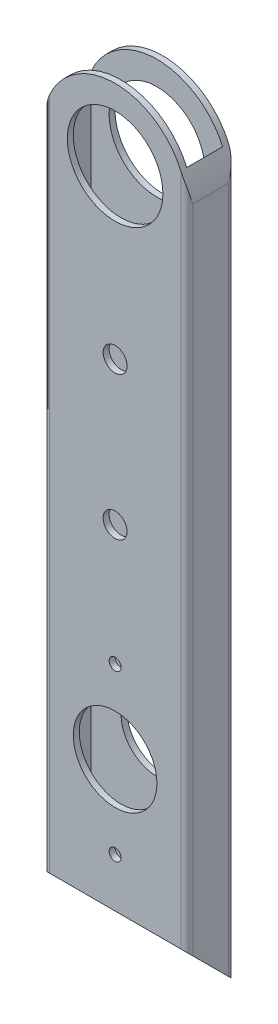
ISO-10303-21;
HEADER;
FILE_DESCRIPTION(('STEP AP214'),'2;1');
FILE_NAME('part.step','',(''),(''),'','','');
FILE_SCHEMA(('AUTOMOTIVE_DESIGN { 1 0 10303 214 1 1 1 1 }'));
ENDSEC;
DATA;
#1=APPLICATION_CONTEXT('core data for automotive mechanical design processes');
#2=APPLICATION_PROTOCOL_DEFINITION('international standard','automotive_design',2000,#1);
#3=PRODUCT_CONTEXT('',#1,'mechanical');
#4=PRODUCT('Part','Part','',(#3));
#5=PRODUCT_RELATED_PRODUCT_CATEGORY('part','',(#4));
#6=PRODUCT_DEFINITION_FORMATION('','',#4);
#7=PRODUCT_DEFINITION_CONTEXT('part definition',#1,'design');
#8=PRODUCT_DEFINITION('design','',#6,#7);
#9=PRODUCT_DEFINITION_SHAPE('','',#8);
#10=(LENGTH_UNIT() NAMED_UNIT(*) SI_UNIT(.MILLI.,.METRE.));
#11=(NAMED_UNIT(*) PLANE_ANGLE_UNIT() SI_UNIT($,.RADIAN.));
#12=(NAMED_UNIT(*) SI_UNIT($,.STERADIAN.) SOLID_ANGLE_UNIT());
#13=UNCERTAINTY_MEASURE_WITH_UNIT(LENGTH_MEASURE(1.E-05),#10,'distance_accuracy_value','');
#14=(GEOMETRIC_REPRESENTATION_CONTEXT(3) GLOBAL_UNCERTAINTY_ASSIGNED_CONTEXT((#13)) GLOBAL_UNIT_ASSIGNED_CONTEXT((#10,
#11,#12)) REPRESENTATION_CONTEXT('',''));
#15=CARTESIAN_POINT('',(0.,0.,0.));
#16=DIRECTION('',(0.,0.,1.));
#17=DIRECTION('',(1.,0.,0.));
#18=AXIS2_PLACEMENT_3D('',#15,#16,#17);
#19=CARTESIAN_POINT('',(38.1,203.2,-1.58750000000001));
#20=DIRECTION('',(-1.,0.,0.));
#21=DIRECTION('',(0.,0.,1.));
#22=AXIS2_PLACEMENT_3D('',#19,#20,#21);
#23=PLANE('',#22);
#24=DIRECTION('',(0.,-1.,0.));
#25=VECTOR('',#24,1.);
#26=CARTESIAN_POINT('',(38.1,203.2,-1.58750000000001));
#27=LINE('',#26,#25);
#28=CARTESIAN_POINT('',(38.1,184.15,-1.58750000000001));
#29=VERTEX_POINT('',#28);
#30=CARTESIAN_POINT('',(38.1,11.1125,-1.58749999999999));
#31=VERTEX_POINT('',#30);
#32=EDGE_CURVE('E162',#29,#31,#27,.T.);
#33=ORIENTED_EDGE('',*,*,#32,.T.);
#34=DIRECTION('',(0.,0.707106781186547,0.707106781186547));
#35=VECTOR('',#34,1.);
#36=CARTESIAN_POINT('',(38.1,0.,-12.7));
#37=LINE('',#36,#35);
#38=CARTESIAN_POINT('',(38.1,1.58750000000002,-11.1125));
#39=VERTEX_POINT('',#38);
#40=EDGE_CURVE('E375',#39,#31,#37,.T.);
#41=ORIENTED_EDGE('',*,*,#40,.F.);
#42=DIRECTION('',(0.,-1.,0.));
#43=VECTOR('',#42,1.);
#44=CARTESIAN_POINT('',(38.1,203.2,-11.1125));
#45=LINE('',#44,#43);
#46=CARTESIAN_POINT('',(38.1,184.15,-11.1125));
#47=VERTEX_POINT('',#46);
#48=EDGE_CURVE('E159',#47,#39,#45,.T.);
#49=ORIENTED_EDGE('',*,*,#48,.F.);
#50=DIRECTION('',(0.,0.,1.));
#51=VECTOR('',#50,1.);
#52=CARTESIAN_POINT('',(38.1,184.15,-12.7));
#53=LINE('',#52,#51);
#54=EDGE_CURVE('E310',#47,#29,#53,.T.);
#55=ORIENTED_EDGE('',*,*,#54,.T.);
#56=EDGE_LOOP('',(#33,#41,#49,#55));
#57=FACE_BOUND('',#56,.T.);
#58=ADVANCED_FACE('F34',(#57),#23,.F.);
#59=CARTESIAN_POINT('',(1.5875,203.2,-1.5875));
#60=DIRECTION('',(0.,-1.,0.));
#61=DIRECTION('',(0.,0.,-1.));
#62=AXIS2_PLACEMENT_3D('',#59,#60,#61);
#63=CYLINDRICAL_SURFACE('',#62,1.5875);
#64=DIRECTION('',(0.,-1.,0.));
#65=VECTOR('',#64,1.);
#66=CARTESIAN_POINT('',(0.,203.2,-1.58750000000001));
#67=LINE('',#66,#65);
#68=CARTESIAN_POINT('',(0.,184.15,-1.58750000000001));
#69=VERTEX_POINT('',#68);
#70=CARTESIAN_POINT('',(0.,11.1125,-1.5875));
#71=VERTEX_POINT('',#70);
#72=EDGE_CURVE('E147',#69,#71,#67,.T.);
#73=ORIENTED_EDGE('',*,*,#72,.T.);
#74=CARTESIAN_POINT('',(1.5875,11.1125,-1.5875));
#75=DIRECTION('',(0.,0.707106781186547,-0.707106781186547));
#76=DIRECTION('',(0.,-0.707106781186548,-0.707106781186548));
#77=AXIS2_PLACEMENT_3D('',#74,#75,#76);
#78=ELLIPSE('',#77,2.24506403026729,1.5875);
#79=CARTESIAN_POINT('',(1.58750000000001,12.7,0.));
#80=VERTEX_POINT('',#79);
#81=EDGE_CURVE('E50',#71,#80,#78,.T.);
#82=ORIENTED_EDGE('',*,*,#81,.T.);
#83=DIRECTION('',(0.,-1.,0.));
#84=VECTOR('',#83,1.);
#85=CARTESIAN_POINT('',(1.58750000000001,203.2,0.));
#86=LINE('',#85,#84);
#87=CARTESIAN_POINT('',(1.58750000000002,191.763382543259,0.));
#88=VERTEX_POINT('',#87);
#89=EDGE_CURVE('E168',#88,#80,#86,.T.);
#90=ORIENTED_EDGE('',*,*,#89,.F.);
#91=CARTESIAN_POINT('',(1.58750000000001,191.763382543259,0.));
#92=CARTESIAN_POINT('',(1.53376495818065,191.640138054539,-2.20127923181103E-05));
#93=CARTESIAN_POINT('',(1.48134884645403,191.51634677516,-0.00272721132376271));
#94=CARTESIAN_POINT('',(1.37922786128263,191.267887621081,-0.0128799698743036));
#95=CARTESIAN_POINT('',(1.32952209970535,191.143220048827,-0.0203259661579967));
#96=CARTESIAN_POINT('',(1.23293387376192,190.89333572705,-0.0393225552435428));
#97=CARTESIAN_POINT('',(1.18604719292055,190.768120114201,-0.0508668302049982));
#98=CARTESIAN_POINT('',(1.09503442027229,190.517067046557,-0.0775720070496662));
#99=CARTESIAN_POINT('',(1.05090859046153,190.391229533965,-0.0927332515169016));
#100=CARTESIAN_POINT('',(0.922969308448521,190.013760253545,-0.142875404943637));
#101=CARTESIAN_POINT('',(0.843273956192606,189.761342510137,-0.182583715714911));
#102=CARTESIAN_POINT('',(0.6948497185621,189.254962806347,-0.271890436384124));
#103=CARTESIAN_POINT('',(0.626126547519453,189.001000112359,-0.321493969678617));
#104=CARTESIAN_POINT('',(0.468855854744227,188.368445417287,-0.454385852694657));
#105=CARTESIAN_POINT('',(0.386872114640803,187.989180843358,-0.542339283056971));
#106=CARTESIAN_POINT('',(0.246538562115965,187.229249942017,-0.729781658305805));
#107=CARTESIAN_POINT('',(0.188193053211932,186.848583372079,-0.829272699464008));
#108=CARTESIAN_POINT('',(0.0480466292446869,185.704992539106,-1.1386101903998));
#109=CARTESIAN_POINT('',(0.00108140591264894,184.940255978614,-1.35937271393351));
#110=CARTESIAN_POINT('',(6.15744997773057E-06,184.167680800396,-1.58239601360152));
#111=CARTESIAN_POINT('',(3.88492361050782E-09,184.158840330417,-1.58494803783133));
#112=CARTESIAN_POINT('',(0.,184.15,-1.5875));
#113=B_SPLINE_CURVE_WITH_KNOTS('',3,(#91,#92,#93,#94,#95,#96,#97,#98,#99,#100,#101,#102,#103,
#104,#105,#106,#107,#108,#109,#110,#111,#112),.UNSPECIFIED.,.F.,.F.,(4,2,2,2,2,2,2,2,2,2,4),(0.,
0.403276855841871,0.806420761100367,1.20894586583019,1.6115091111792,2.41396604086429,
3.21683953784447,4.40933258199479,5.60204263099948,7.98676642553446,8.0143707791923),.UNSPECIFIED.);
#114=EDGE_CURVE('E194',#88,#69,#113,.T.);
#115=ORIENTED_EDGE('',*,*,#114,.T.);
#116=EDGE_LOOP('',(#73,#82,#90,#115));
#117=FACE_BOUND('',#116,.T.);
#118=ADVANCED_FACE('F36',(#117),#63,.T.);
#119=CARTESIAN_POINT('',(1.58750000000001,203.2,0.));
#120=DIRECTION('',(0.,0.,-1.));
#121=DIRECTION('',(-1.,0.,0.));
#122=AXIS2_PLACEMENT_3D('',#119,#120,#121);
#123=PLANE('',#122);
#124=CARTESIAN_POINT('',(19.05,47.625,0.));
#125=DIRECTION('',(0.,0.,1.));
#126=DIRECTION('',(1.,0.,0.));
#127=AXIS2_PLACEMENT_3D('',#124,#125,#126);
#128=CIRCLE('',#127,11.1125);
#129=CARTESIAN_POINT('',(30.1625,47.625,0.));
#130=VERTEX_POINT('',#129);
#131=EDGE_CURVE('E270',#130,#130,#128,.T.);
#132=ORIENTED_EDGE('',*,*,#131,.F.);
#133=EDGE_LOOP('',(#132));
#134=FACE_BOUND('',#133,.T.);
#135=CARTESIAN_POINT('',(19.05,25.704689783217,0.));
#136=DIRECTION('',(0.,0.,1.));
#137=DIRECTION('',(1.,0.,0.));
#138=AXIS2_PLACEMENT_3D('',#135,#136,#137);
#139=CIRCLE('',#138,1.5875);
#140=CARTESIAN_POINT('',(20.6375,25.704689783217,0.));
#141=VERTEX_POINT('',#140);
#142=EDGE_CURVE('E274',#141,#141,#139,.T.);
#143=ORIENTED_EDGE('',*,*,#142,.F.);
#144=EDGE_LOOP('',(#143));
#145=FACE_BOUND('',#144,.T.);
#146=CARTESIAN_POINT('',(19.05,184.15,0.));
#147=DIRECTION('',(0.,0.,1.));
#148=DIRECTION('',(1.,0.,0.));
#149=AXIS2_PLACEMENT_3D('',#146,#147,#148);
#150=CIRCLE('',#149,12.7);
#151=CARTESIAN_POINT('',(31.75,184.15,0.));
#152=VERTEX_POINT('',#151);
#153=EDGE_CURVE('E278',#152,#152,#150,.T.);
#154=ORIENTED_EDGE('',*,*,#153,.F.);
#155=EDGE_LOOP('',(#154));
#156=FACE_BOUND('',#155,.T.);
#157=CARTESIAN_POINT('',(19.05,139.7,0.));
#158=DIRECTION('',(0.,0.,1.));
#159=DIRECTION('',(1.,0.,0.));
#160=AXIS2_PLACEMENT_3D('',#157,#158,#159);
#161=CIRCLE('',#160,3.175);
#162=CARTESIAN_POINT('',(22.225,139.7,0.));
#163=VERTEX_POINT('',#162);
#164=EDGE_CURVE('E282',#163,#163,#161,.T.);
#165=ORIENTED_EDGE('',*,*,#164,.F.);
#166=EDGE_LOOP('',(#165));
#167=FACE_BOUND('',#166,.T.);
#168=CARTESIAN_POINT('',(19.05,69.545310216783,0.));
#169=DIRECTION('',(0.,0.,1.));
#170=DIRECTION('',(1.,0.,0.));
#171=AXIS2_PLACEMENT_3D('',#168,#169,#170);
#172=CIRCLE('',#171,1.5875);
#173=CARTESIAN_POINT('',(20.6375,69.545310216783,0.));
#174=VERTEX_POINT('',#173);
#175=EDGE_CURVE('E286',#174,#174,#172,.T.);
#176=ORIENTED_EDGE('',*,*,#175,.F.);
#177=EDGE_LOOP('',(#176));
#178=FACE_BOUND('',#177,.T.);
#179=CARTESIAN_POINT('',(19.05,101.6,0.));
#180=DIRECTION('',(0.,0.,1.));
#181=DIRECTION('',(1.,0.,0.));
#182=AXIS2_PLACEMENT_3D('',#179,#180,#181);
#183=CIRCLE('',#182,3.175);
#184=CARTESIAN_POINT('',(22.225,101.6,0.));
#185=VERTEX_POINT('',#184);
#186=EDGE_CURVE('E290',#185,#185,#183,.T.);
#187=ORIENTED_EDGE('',*,*,#186,.F.);
#188=EDGE_LOOP('',(#187));
#189=FACE_BOUND('',#188,.T.);
#190=ORIENTED_EDGE('',*,*,#89,.T.);
#191=DIRECTION('',(1.,0.,0.));
#192=VECTOR('',#191,1.);
#193=CARTESIAN_POINT('',(0.,12.7,0.));
#194=LINE('',#193,#192);
#195=CARTESIAN_POINT('',(36.5125,12.7,0.));
#196=VERTEX_POINT('',#195);
#197=EDGE_CURVE('E293',#80,#196,#194,.T.);
#198=ORIENTED_EDGE('',*,*,#197,.T.);
#199=DIRECTION('',(0.,-1.,0.));
#200=VECTOR('',#199,1.);
#201=CARTESIAN_POINT('',(36.5125,203.2,0.));
#202=LINE('',#201,#200);
#203=CARTESIAN_POINT('',(36.5125,191.763382543259,0.));
#204=VERTEX_POINT('',#203);
#205=EDGE_CURVE('E165',#204,#196,#202,.T.);
#206=ORIENTED_EDGE('',*,*,#205,.F.);
#207=CARTESIAN_POINT('',(19.05,184.15,0.));
#208=DIRECTION('',(0.,0.,-1.));
#209=DIRECTION('',(-1.,0.,0.));
#210=AXIS2_PLACEMENT_3D('',#207,#208,#209);
#211=CIRCLE('',#210,19.05);
#212=EDGE_CURVE('E294',#88,#204,#211,.T.);
#213=ORIENTED_EDGE('',*,*,#212,.F.);
#214=EDGE_LOOP('',(#190,#198,#206,#213));
#215=FACE_BOUND('',#214,.T.);
#216=ADVANCED_FACE('F260',(#134,#145,#156,#167,#178,#189,#215),#123,.F.);
#217=CARTESIAN_POINT('',(36.5125,203.2,-1.5875));
#218=DIRECTION('',(0.,-1.,0.));
#219=DIRECTION('',(0.,0.,-1.));
#220=AXIS2_PLACEMENT_3D('',#217,#218,#219);
#221=CYLINDRICAL_SURFACE('',#220,1.5875);
#222=ORIENTED_EDGE('',*,*,#205,.T.);
#223=CARTESIAN_POINT('',(36.5125,11.1125,-1.5875));
#224=DIRECTION('',(0.,0.707106781186547,-0.707106781186547));
#225=DIRECTION('',(0.,-0.707106781186548,-0.707106781186548));
#226=AXIS2_PLACEMENT_3D('',#223,#224,#225);
#227=ELLIPSE('',#226,2.24506403026729,1.5875);
#228=EDGE_CURVE('E295',#196,#31,#227,.T.);
#229=ORIENTED_EDGE('',*,*,#228,.T.);
#230=ORIENTED_EDGE('',*,*,#32,.F.);
#231=CARTESIAN_POINT('',(36.5125,191.763382543259,0.));
#232=CARTESIAN_POINT('',(36.5662350418193,191.640138054539,-2.20127923186478E-05));
#233=CARTESIAN_POINT('',(36.618651153546,191.51634677516,-0.00272721132376353));
#234=CARTESIAN_POINT('',(36.7207721387174,191.267887621081,-0.0128799698743059));
#235=CARTESIAN_POINT('',(36.7704779002947,191.143220048827,-0.0203259661580004));
#236=CARTESIAN_POINT('',(36.8670661262381,190.89333572705,-0.0393225552435498));
#237=CARTESIAN_POINT('',(36.9139528070795,190.768120114201,-0.0508668302050063));
#238=CARTESIAN_POINT('',(37.0049655797277,190.517067046557,-0.0775720070496772));
#239=CARTESIAN_POINT('',(37.0490914095385,190.391229533965,-0.0927332515169146));
#240=CARTESIAN_POINT('',(37.1770306915515,190.013760253544,-0.142875404943651));
#241=CARTESIAN_POINT('',(37.2567260438074,189.761342510137,-0.182583715714923));
#242=CARTESIAN_POINT('',(37.4051502814379,189.254962806347,-0.271890436384127));
#243=CARTESIAN_POINT('',(37.4738734524806,189.001000112359,-0.321493969678612));
#244=CARTESIAN_POINT('',(37.6311441452558,188.368445417287,-0.454385852694663));
#245=CARTESIAN_POINT('',(37.7131278853592,187.989180843358,-0.542339283057008));
#246=CARTESIAN_POINT('',(37.853461437884,187.229249942017,-0.729781658305762));
#247=CARTESIAN_POINT('',(37.9118069467881,186.848583372079,-0.829272699463855));
#248=CARTESIAN_POINT('',(38.0519533707553,185.704992539107,-1.13861019040006));
#249=CARTESIAN_POINT('',(38.0989185940874,184.940255978615,-1.35937271393502));
#250=CARTESIAN_POINT('',(38.09999384255,184.167680800396,-1.58239601360154));
#251=CARTESIAN_POINT('',(38.0999999961151,184.158840330417,-1.58494803783134));
#252=CARTESIAN_POINT('',(38.1,184.15,-1.5875));
#253=B_SPLINE_CURVE_WITH_KNOTS('',3,(#231,#232,#233,#234,#235,#236,#237,#238,#239,#240,#241,
#242,#243,#244,#245,#246,#247,#248,#249,#250,#251,#252),.UNSPECIFIED.,.F.,.F.,(4,2,2,2,2,2,2,2,
2,2,4),(0.,0.403276855841901,0.806420761100455,1.20894586583028,1.61150911117932,
2.41396604086432,3.21683953784447,4.40933258199476,5.60204263099942,7.98676642553439,
8.0143707791923),.UNSPECIFIED.);
#254=EDGE_CURVE('E201',#29,#204,#253,.F.);
#255=ORIENTED_EDGE('',*,*,#254,.T.);
#256=EDGE_LOOP('',(#222,#229,#230,#255));
#257=FACE_BOUND('',#256,.T.);
#258=ADVANCED_FACE('F254',(#257),#221,.T.);
#259=CARTESIAN_POINT('',(36.5125,203.2,-11.1125));
#260=DIRECTION('',(0.,-1.,0.));
#261=DIRECTION('',(0.,0.,-1.));
#262=AXIS2_PLACEMENT_3D('',#259,#260,#261);
#263=CYLINDRICAL_SURFACE('',#262,1.5875);
#264=ORIENTED_EDGE('',*,*,#48,.T.);
#265=CARTESIAN_POINT('',(36.5125,1.58750000000002,-11.1125));
#266=DIRECTION('',(0.,0.707106781186547,-0.707106781186547));
#267=DIRECTION('',(0.,-0.707106781186548,-0.707106781186548));
#268=AXIS2_PLACEMENT_3D('',#265,#266,#267);
#269=ELLIPSE('',#268,2.24506403026729,1.5875);
#270=CARTESIAN_POINT('',(36.5125,0.,-12.7));
#271=VERTEX_POINT('',#270);
#272=EDGE_CURVE('E131',#39,#271,#269,.T.);
#273=ORIENTED_EDGE('',*,*,#272,.T.);
#274=DIRECTION('',(0.,-1.,0.));
#275=VECTOR('',#274,1.);
#276=CARTESIAN_POINT('',(36.5125,203.2,-12.7));
#277=LINE('',#276,#275);
#278=CARTESIAN_POINT('',(36.5125,191.763382543259,-12.7));
#279=VERTEX_POINT('',#278);
#280=EDGE_CURVE('E141',#279,#271,#277,.T.);
#281=ORIENTED_EDGE('',*,*,#280,.F.);
#282=CARTESIAN_POINT('',(36.5125,191.763382543259,-12.7));
#283=CARTESIAN_POINT('',(36.5662350418193,191.640138054539,-12.6999779872077));
#284=CARTESIAN_POINT('',(36.618651153546,191.51634677516,-12.6972727886762));
#285=CARTESIAN_POINT('',(36.7207721387174,191.267887621081,-12.6871200301257));
#286=CARTESIAN_POINT('',(36.7704779002946,191.143220048827,-12.679674033842));
#287=CARTESIAN_POINT('',(36.8670661262381,190.89333572705,-12.6606774447565));
#288=CARTESIAN_POINT('',(36.9139528070794,190.768120114201,-12.649133169795));
#289=CARTESIAN_POINT('',(37.0049655797277,190.517067046557,-12.6224279929503));
#290=CARTESIAN_POINT('',(37.0490914095384,190.391229533965,-12.6072667484831));
#291=CARTESIAN_POINT('',(37.1770306915515,190.013760253545,-12.5571245950564));
#292=CARTESIAN_POINT('',(37.2567260438074,189.761342510137,-12.5174162842851));
#293=CARTESIAN_POINT('',(37.4051502814379,189.254962806347,-12.4281095636159));
#294=CARTESIAN_POINT('',(37.4738734524805,189.001000112359,-12.3785060303214));
#295=CARTESIAN_POINT('',(37.6311441452558,188.368445417287,-12.2456141473054));
#296=CARTESIAN_POINT('',(37.7131278853592,187.989180843358,-12.1576607169431));
#297=CARTESIAN_POINT('',(37.853461437884,187.229249942017,-11.9702183416942));
#298=CARTESIAN_POINT('',(37.9118069467881,186.848583372079,-11.8707273005358));
#299=CARTESIAN_POINT('',(38.0519533707553,185.704992539106,-11.5613898096005));
#300=CARTESIAN_POINT('',(38.0989185940874,184.940255978614,-11.3406272860681));
#301=CARTESIAN_POINT('',(38.09999384255,184.167680800396,-11.1176039863985));
#302=CARTESIAN_POINT('',(38.0999999961151,184.158840330417,-11.1150519621687));
#303=CARTESIAN_POINT('',(38.1,184.15,-11.1125));
#304=B_SPLINE_CURVE_WITH_KNOTS('',3,(#282,#283,#284,#285,#286,#287,#288,#289,#290,#291,#292,
#293,#294,#295,#296,#297,#298,#299,#300,#301,#302,#303),.UNSPECIFIED.,.F.,.F.,(4,2,2,2,2,2,2,2,
2,2,4),(0.,0.403276855841873,0.806420761100337,1.20894586583014,1.61150911117911,
2.4139660408642,3.21683953784447,4.40933258199478,5.60204263099946,7.98676642553438,
8.0143707791923),.UNSPECIFIED.);
#305=EDGE_CURVE('E208',#279,#47,#304,.T.);
#306=ORIENTED_EDGE('',*,*,#305,.T.);
#307=EDGE_LOOP('',(#264,#273,#281,#306));
#308=FACE_BOUND('',#307,.T.);
#309=ADVANCED_FACE('F249',(#308),#263,.T.);
#310=CARTESIAN_POINT('',(1.58750000000001,203.2,-12.7));
#311=DIRECTION('',(0.,0.,1.));
#312=DIRECTION('',(1.,0.,0.));
#313=AXIS2_PLACEMENT_3D('',#310,#311,#312);
#314=PLANE('',#313);
#315=CARTESIAN_POINT('',(19.05,25.704689783217,-12.7));
#316=DIRECTION('',(0.,0.,1.));
#317=DIRECTION('',(1.,0.,0.));
#318=AXIS2_PLACEMENT_3D('',#315,#316,#317);
#319=CIRCLE('',#318,1.5875);
#320=CARTESIAN_POINT('',(20.6375,25.704689783217,-12.7));
#321=VERTEX_POINT('',#320);
#322=EDGE_CURVE('E312',#321,#321,#319,.T.);
#323=ORIENTED_EDGE('',*,*,#322,.T.);
#324=EDGE_LOOP('',(#323));
#325=FACE_BOUND('',#324,.T.);
#326=CARTESIAN_POINT('',(19.05,184.15,-12.7));
#327=DIRECTION('',(0.,0.,1.));
#328=DIRECTION('',(1.,0.,0.));
#329=AXIS2_PLACEMENT_3D('',#326,#327,#328);
#330=CIRCLE('',#329,12.7);
#331=CARTESIAN_POINT('',(31.75,184.15,-12.7));
#332=VERTEX_POINT('',#331);
#333=EDGE_CURVE('E324',#332,#332,#330,.T.);
#334=ORIENTED_EDGE('',*,*,#333,.T.);
#335=EDGE_LOOP('',(#334));
#336=FACE_BOUND('',#335,.T.);
#337=CARTESIAN_POINT('',(19.05,139.7,-12.7));
#338=DIRECTION('',(0.,0.,1.));
#339=DIRECTION('',(1.,0.,0.));
#340=AXIS2_PLACEMENT_3D('',#337,#338,#339);
#341=CIRCLE('',#340,3.175);
#342=CARTESIAN_POINT('',(22.225,139.7,-12.7));
#343=VERTEX_POINT('',#342);
#344=EDGE_CURVE('E320',#343,#343,#341,.T.);
#345=ORIENTED_EDGE('',*,*,#344,.T.);
#346=EDGE_LOOP('',(#345));
#347=FACE_BOUND('',#346,.T.);
#348=CARTESIAN_POINT('',(19.05,47.625,-12.7));
#349=DIRECTION('',(0.,0.,1.));
#350=DIRECTION('',(1.,0.,0.));
#351=AXIS2_PLACEMENT_3D('',#348,#349,#350);
#352=CIRCLE('',#351,9.525);
#353=CARTESIAN_POINT('',(28.575,47.625,-12.7));
#354=VERTEX_POINT('',#353);
#355=EDGE_CURVE('E303',#354,#354,#352,.T.);
#356=ORIENTED_EDGE('',*,*,#355,.T.);
#357=EDGE_LOOP('',(#356));
#358=FACE_BOUND('',#357,.T.);
#359=CARTESIAN_POINT('',(19.05,69.545310216783,-12.7));
#360=DIRECTION('',(0.,0.,1.));
#361=DIRECTION('',(1.,0.,0.));
#362=AXIS2_PLACEMENT_3D('',#359,#360,#361);
#363=CIRCLE('',#362,1.5875);
#364=CARTESIAN_POINT('',(20.6375,69.545310216783,-12.7));
#365=VERTEX_POINT('',#364);
#366=EDGE_CURVE('E297',#365,#365,#363,.T.);
#367=ORIENTED_EDGE('',*,*,#366,.T.);
#368=EDGE_LOOP('',(#367));
#369=FACE_BOUND('',#368,.T.);
#370=CARTESIAN_POINT('',(19.05,101.6,-12.7));
#371=DIRECTION('',(0.,0.,1.));
#372=DIRECTION('',(1.,0.,0.));
#373=AXIS2_PLACEMENT_3D('',#370,#371,#372);
#374=CIRCLE('',#373,3.175);
#375=CARTESIAN_POINT('',(22.225,101.6,-12.7));
#376=VERTEX_POINT('',#375);
#377=EDGE_CURVE('E175',#376,#376,#374,.T.);
#378=ORIENTED_EDGE('',*,*,#377,.T.);
#379=EDGE_LOOP('',(#378));
#380=FACE_BOUND('',#379,.T.);
#381=DIRECTION('',(0.,-1.,0.));
#382=VECTOR('',#381,1.);
#383=CARTESIAN_POINT('',(1.58750000000001,203.2,-12.7));
#384=LINE('',#383,#382);
#385=CARTESIAN_POINT('',(1.5875,191.763382543259,-12.7));
#386=VERTEX_POINT('',#385);
#387=CARTESIAN_POINT('',(1.5875,0.,-12.7));
#388=VERTEX_POINT('',#387);
#389=EDGE_CURVE('E136',#386,#388,#384,.T.);
#390=ORIENTED_EDGE('',*,*,#389,.F.);
#391=CARTESIAN_POINT('',(19.05,184.15,-12.7));
#392=DIRECTION('',(0.,0.,-1.));
#393=DIRECTION('',(-1.,0.,0.));
#394=AXIS2_PLACEMENT_3D('',#391,#392,#393);
#395=CIRCLE('',#394,19.05);
#396=EDGE_CURVE('E308',#386,#279,#395,.T.);
#397=ORIENTED_EDGE('',*,*,#396,.T.);
#398=ORIENTED_EDGE('',*,*,#280,.T.);
#399=DIRECTION('',(-1.,0.,0.));
#400=VECTOR('',#399,1.);
#401=CARTESIAN_POINT('',(1.58750000000001,0.,-12.7));
#402=LINE('',#401,#400);
#403=EDGE_CURVE('E125',#271,#388,#402,.T.);
#404=ORIENTED_EDGE('',*,*,#403,.T.);
#405=EDGE_LOOP('',(#390,#397,#398,#404));
#406=FACE_BOUND('',#405,.T.);
#407=ADVANCED_FACE('F145',(#325,#336,#347,#358,#369,#380,#406),#314,.F.);
#408=CARTESIAN_POINT('',(1.5875,203.2,-11.1125));
#409=DIRECTION('',(0.,-1.,0.));
#410=DIRECTION('',(0.,0.,-1.));
#411=AXIS2_PLACEMENT_3D('',#408,#409,#410);
#412=CYLINDRICAL_SURFACE('',#411,1.5875);
#413=ORIENTED_EDGE('',*,*,#389,.T.);
#414=CARTESIAN_POINT('',(1.5875,1.58750000000002,-11.1125));
#415=DIRECTION('',(0.,0.707106781186547,-0.707106781186547));
#416=DIRECTION('',(0.,-0.707106781186548,-0.707106781186548));
#417=AXIS2_PLACEMENT_3D('',#414,#415,#416);
#418=ELLIPSE('',#417,2.24506403026729,1.5875);
#419=CARTESIAN_POINT('',(0.,1.5875,-11.1125));
#420=VERTEX_POINT('',#419);
#421=EDGE_CURVE('E121',#388,#420,#418,.T.);
#422=ORIENTED_EDGE('',*,*,#421,.T.);
#423=DIRECTION('',(0.,-1.,0.));
#424=VECTOR('',#423,1.);
#425=CARTESIAN_POINT('',(0.,203.2,-11.1125));
#426=LINE('',#425,#424);
#427=CARTESIAN_POINT('',(0.,184.15,-11.1125));
#428=VERTEX_POINT('',#427);
#429=EDGE_CURVE('E142',#428,#420,#426,.T.);
#430=ORIENTED_EDGE('',*,*,#429,.F.);
#431=CARTESIAN_POINT('',(1.58750000000001,191.763382543259,-12.7));
#432=CARTESIAN_POINT('',(1.53376495818056,191.640138054538,-12.6999779872077));
#433=CARTESIAN_POINT('',(1.48134884645384,191.51634677516,-12.6972727886762));
#434=CARTESIAN_POINT('',(1.37922786128227,191.26788762108,-12.6871200301257));
#435=CARTESIAN_POINT('',(1.32952209970491,191.143220048826,-12.6796740338419));
#436=CARTESIAN_POINT('',(1.23293387376135,190.893335727049,-12.6606774447563));
#437=CARTESIAN_POINT('',(1.18604719291993,190.768120114199,-12.6491331697948));
#438=CARTESIAN_POINT('',(1.09503442027157,190.517067046555,-12.6224279929501));
#439=CARTESIAN_POINT('',(1.05090859046076,190.391229533963,-12.6072667484828));
#440=CARTESIAN_POINT('',(0.922969308447896,190.013760253543,-12.5571245950561));
#441=CARTESIAN_POINT('',(0.843273956192143,189.761342510136,-12.5174162842848));
#442=CARTESIAN_POINT('',(0.694849718561904,189.254962806346,-12.4281095636158));
#443=CARTESIAN_POINT('',(0.626126547519364,189.001000112359,-12.3785060303214));
#444=CARTESIAN_POINT('',(0.468855854744242,188.368445417288,-12.2456141473052));
#445=CARTESIAN_POINT('',(0.386872114640826,187.989180843358,-12.1576607169423));
#446=CARTESIAN_POINT('',(0.246538562116026,187.229249942017,-11.9702183416951));
#447=CARTESIAN_POINT('',(0.188193053212019,186.848583372078,-11.8707273005391));
#448=CARTESIAN_POINT('',(0.0480466292446686,185.704992539109,-11.5613898095944));
#449=CARTESIAN_POINT('',(0.00108140591244265,184.940255978624,-11.3406272860341));
#450=CARTESIAN_POINT('',(6.15744997511764E-06,184.167680800396,-11.1176039863977));
#451=CARTESIAN_POINT('',(3.88492337993301E-09,184.158840330417,-11.1150519621683));
#452=CARTESIAN_POINT('',(0.,184.15,-11.1125));
#453=B_SPLINE_CURVE_WITH_KNOTS('',3,(#431,#432,#433,#434,#435,#436,#437,#438,#439,#440,#441,
#442,#443,#444,#445,#446,#447,#448,#449,#450,#451,#452),.UNSPECIFIED.,.F.,.F.,(4,2,2,2,2,2,2,2,
2,2,4),(0.,0.403276855842592,0.806420761101797,1.20894586583218,1.61150911118171,
2.41396604086543,3.21683953784447,4.40933258199458,5.60204263099885,7.98676642553452,
8.0143707791923),.UNSPECIFIED.);
#454=EDGE_CURVE('E138',#428,#386,#453,.F.);
#455=ORIENTED_EDGE('',*,*,#454,.T.);
#456=EDGE_LOOP('',(#413,#422,#430,#455));
#457=FACE_BOUND('',#456,.T.);
#458=ADVANCED_FACE('F137',(#457),#412,.T.);
#459=CARTESIAN_POINT('',(0.,203.2,-1.58750000000001));
#460=DIRECTION('',(1.,0.,0.));
#461=DIRECTION('',(0.,0.,-1.));
#462=AXIS2_PLACEMENT_3D('',#459,#460,#461);
#463=PLANE('',#462);
#464=ORIENTED_EDGE('',*,*,#429,.T.);
#465=DIRECTION('',(0.,0.707106781186547,0.707106781186547));
#466=VECTOR('',#465,1.);
#467=CARTESIAN_POINT('',(0.,0.,-12.7));
#468=LINE('',#467,#466);
#469=EDGE_CURVE('E127',#420,#71,#468,.T.);
#470=ORIENTED_EDGE('',*,*,#469,.T.);
#471=ORIENTED_EDGE('',*,*,#72,.F.);
#472=DIRECTION('',(0.,0.,1.));
#473=VECTOR('',#472,1.);
#474=CARTESIAN_POINT('',(0.,184.15,-12.7));
#475=LINE('',#474,#473);
#476=EDGE_CURVE('E313',#428,#69,#475,.T.);
#477=ORIENTED_EDGE('',*,*,#476,.F.);
#478=EDGE_LOOP('',(#464,#470,#471,#477));
#479=FACE_BOUND('',#478,.T.);
#480=ADVANCED_FACE('F397',(#479),#463,.F.);
#481=CARTESIAN_POINT('',(1.5875,203.2,-1.5875));
#482=DIRECTION('',(1.,0.,0.));
#483=DIRECTION('',(0.,0.,-1.));
#484=AXIS2_PLACEMENT_3D('',#481,#482,#483);
#485=PLANE('',#484);
#486=DIRECTION('',(0.,0.707106781186548,0.707106781186548));
#487=VECTOR('',#486,1.);
#488=CARTESIAN_POINT('',(1.5875,107.15625,94.45625));
#489=LINE('',#488,#487);
#490=CARTESIAN_POINT('',(1.5875,1.58750000000002,-11.1125));
#491=VERTEX_POINT('',#490);
#492=CARTESIAN_POINT('',(1.5875,11.1125,-1.5875));
#493=VERTEX_POINT('',#492);
#494=EDGE_CURVE('E132',#491,#493,#489,.T.);
#495=ORIENTED_EDGE('',*,*,#494,.F.);
#496=DIRECTION('',(0.,-1.,0.));
#497=VECTOR('',#496,1.);
#498=CARTESIAN_POINT('',(1.5875,203.2,-11.1125));
#499=LINE('',#498,#497);
#500=CARTESIAN_POINT('',(1.5875,191.763382543259,-11.1125));
#501=VERTEX_POINT('',#500);
#502=EDGE_CURVE('E198',#501,#491,#499,.T.);
#503=ORIENTED_EDGE('',*,*,#502,.F.);
#504=DIRECTION('',(0.,0.,1.));
#505=VECTOR('',#504,1.);
#506=CARTESIAN_POINT('',(1.5875,191.763382543259,-12.7));
#507=LINE('',#506,#505);
#508=CARTESIAN_POINT('',(1.5875,191.763382543259,-1.5875));
#509=VERTEX_POINT('',#508);
#510=EDGE_CURVE('E342',#509,#501,#507,.F.);
#511=ORIENTED_EDGE('',*,*,#510,.F.);
#512=DIRECTION('',(0.,-1.,0.));
#513=VECTOR('',#512,1.);
#514=CARTESIAN_POINT('',(1.5875,203.2,-1.5875));
#515=LINE('',#514,#513);
#516=EDGE_CURVE('E148',#509,#493,#515,.T.);
#517=ORIENTED_EDGE('',*,*,#516,.T.);
#518=EDGE_LOOP('',(#495,#503,#511,#517));
#519=FACE_BOUND('',#518,.T.);
#520=ADVANCED_FACE('F353',(#519),#485,.T.);
#521=CARTESIAN_POINT('',(1.5875,203.2,-1.5875));
#522=DIRECTION('',(0.,0.,-1.));
#523=DIRECTION('',(-1.,0.,0.));
#524=AXIS2_PLACEMENT_3D('',#521,#522,#523);
#525=PLANE('',#524);
#526=CARTESIAN_POINT('',(19.05,47.625,-1.5875));
#527=DIRECTION('',(0.,0.,-1.));
#528=DIRECTION('',(-1.,0.,0.));
#529=AXIS2_PLACEMENT_3D('',#526,#527,#528);
#530=CIRCLE('',#529,11.1125);
#531=CARTESIAN_POINT('',(7.9375,47.625,-1.5875));
#532=VERTEX_POINT('',#531);
#533=EDGE_CURVE('E377',#532,#532,#530,.F.);
#534=ORIENTED_EDGE('',*,*,#533,.T.);
#535=EDGE_LOOP('',(#534));
#536=FACE_BOUND('',#535,.T.);
#537=DIRECTION('',(1.,0.,0.));
#538=VECTOR('',#537,1.);
#539=CARTESIAN_POINT('',(1.5875,11.1125,-1.5875));
#540=LINE('',#539,#538);
#541=CARTESIAN_POINT('',(36.5125,11.1125,-1.58750000000001));
#542=VERTEX_POINT('',#541);
#543=EDGE_CURVE('E364',#493,#542,#540,.T.);
#544=ORIENTED_EDGE('',*,*,#543,.F.);
#545=ORIENTED_EDGE('',*,*,#516,.F.);
#546=CARTESIAN_POINT('',(19.05,184.15,-1.5875));
#547=DIRECTION('',(0.,0.,-1.));
#548=DIRECTION('',(-1.,0.,0.));
#549=AXIS2_PLACEMENT_3D('',#546,#547,#548);
#550=CIRCLE('',#549,19.05);
#551=CARTESIAN_POINT('',(36.5125,191.763382543259,-1.5875));
#552=VERTEX_POINT('',#551);
#553=EDGE_CURVE('E341',#552,#509,#550,.F.);
#554=ORIENTED_EDGE('',*,*,#553,.F.);
#555=DIRECTION('',(0.,-1.,0.));
#556=VECTOR('',#555,1.);
#557=CARTESIAN_POINT('',(36.5125,203.2,-1.5875));
#558=LINE('',#557,#556);
#559=EDGE_CURVE('E153',#552,#542,#558,.T.);
#560=ORIENTED_EDGE('',*,*,#559,.T.);
#561=EDGE_LOOP('',(#544,#545,#554,#560));
#562=FACE_BOUND('',#561,.T.);
#563=CARTESIAN_POINT('',(19.05,25.704689783217,-1.5875));
#564=DIRECTION('',(0.,0.,-1.));
#565=DIRECTION('',(-1.,0.,0.));
#566=AXIS2_PLACEMENT_3D('',#563,#564,#565);
#567=CIRCLE('',#566,1.5875);
#568=CARTESIAN_POINT('',(17.4625,25.704689783217,-1.5875));
#569=VERTEX_POINT('',#568);
#570=EDGE_CURVE('E193',#569,#569,#567,.T.);
#571=ORIENTED_EDGE('',*,*,#570,.F.);
#572=EDGE_LOOP('',(#571));
#573=FACE_BOUND('',#572,.T.);
#574=CARTESIAN_POINT('',(19.05,184.15,-1.5875));
#575=DIRECTION('',(0.,0.,-1.));
#576=DIRECTION('',(-1.,0.,0.));
#577=AXIS2_PLACEMENT_3D('',#574,#575,#576);
#578=CIRCLE('',#577,12.7);
#579=CARTESIAN_POINT('',(6.35,184.15,-1.5875));
#580=VERTEX_POINT('',#579);
#581=EDGE_CURVE('E190',#580,#580,#578,.T.);
#582=ORIENTED_EDGE('',*,*,#581,.F.);
#583=EDGE_LOOP('',(#582));
#584=FACE_BOUND('',#583,.T.);
#585=CARTESIAN_POINT('',(19.05,139.7,-1.5875));
#586=DIRECTION('',(0.,0.,-1.));
#587=DIRECTION('',(-1.,0.,0.));
#588=AXIS2_PLACEMENT_3D('',#585,#586,#587);
#589=CIRCLE('',#588,3.175);
#590=CARTESIAN_POINT('',(15.875,139.7,-1.5875));
#591=VERTEX_POINT('',#590);
#592=EDGE_CURVE('E186',#591,#591,#589,.T.);
#593=ORIENTED_EDGE('',*,*,#592,.F.);
#594=EDGE_LOOP('',(#593));
#595=FACE_BOUND('',#594,.T.);
#596=CARTESIAN_POINT('',(19.05,69.545310216783,-1.5875));
#597=DIRECTION('',(0.,0.,-1.));
#598=DIRECTION('',(-1.,0.,0.));
#599=AXIS2_PLACEMENT_3D('',#596,#597,#598);
#600=CIRCLE('',#599,1.5875);
#601=CARTESIAN_POINT('',(17.4625,69.545310216783,-1.5875));
#602=VERTEX_POINT('',#601);
#603=EDGE_CURVE('E179',#602,#602,#600,.T.);
#604=ORIENTED_EDGE('',*,*,#603,.F.);
#605=EDGE_LOOP('',(#604));
#606=FACE_BOUND('',#605,.T.);
#607=CARTESIAN_POINT('',(19.05,101.6,-1.5875));
#608=DIRECTION('',(0.,0.,-1.));
#609=DIRECTION('',(-1.,0.,0.));
#610=AXIS2_PLACEMENT_3D('',#607,#608,#609);
#611=CIRCLE('',#610,3.175);
#612=CARTESIAN_POINT('',(15.875,101.6,-1.5875));
#613=VERTEX_POINT('',#612);
#614=EDGE_CURVE('E174',#613,#613,#611,.T.);
#615=ORIENTED_EDGE('',*,*,#614,.F.);
#616=EDGE_LOOP('',(#615));
#617=FACE_BOUND('',#616,.T.);
#618=ADVANCED_FACE('F362',(#536,#562,#573,#584,#595,#606,#617),#525,.T.);
#619=CARTESIAN_POINT('',(36.5125,203.2,-1.5875));
#620=DIRECTION('',(-1.,0.,0.));
#621=DIRECTION('',(0.,0.,1.));
#622=AXIS2_PLACEMENT_3D('',#619,#620,#621);
#623=PLANE('',#622);
#624=DIRECTION('',(0.,-0.707106781186548,-0.707106781186548));
#625=VECTOR('',#624,1.);
#626=CARTESIAN_POINT('',(36.5125,107.15625,94.45625));
#627=LINE('',#626,#625);
#628=CARTESIAN_POINT('',(36.5125,1.58750000000002,-11.1125));
#629=VERTEX_POINT('',#628);
#630=EDGE_CURVE('E57',#542,#629,#627,.T.);
#631=ORIENTED_EDGE('',*,*,#630,.F.);
#632=ORIENTED_EDGE('',*,*,#559,.F.);
#633=DIRECTION('',(0.,0.,1.));
#634=VECTOR('',#633,1.);
#635=CARTESIAN_POINT('',(36.5125,191.763382543259,-12.7));
#636=LINE('',#635,#634);
#637=CARTESIAN_POINT('',(36.5125,191.763382543259,-11.1125));
#638=VERTEX_POINT('',#637);
#639=EDGE_CURVE('E339',#638,#552,#636,.T.);
#640=ORIENTED_EDGE('',*,*,#639,.F.);
#641=DIRECTION('',(0.,-1.,0.));
#642=VECTOR('',#641,1.);
#643=CARTESIAN_POINT('',(36.5125,203.2,-11.1125));
#644=LINE('',#643,#642);
#645=EDGE_CURVE('E355',#638,#629,#644,.T.);
#646=ORIENTED_EDGE('',*,*,#645,.T.);
#647=EDGE_LOOP('',(#631,#632,#640,#646));
#648=FACE_BOUND('',#647,.T.);
#649=ADVANCED_FACE('F366',(#648),#623,.T.);
#650=CARTESIAN_POINT('',(1.5875,203.2,-11.1125));
#651=DIRECTION('',(0.,0.,1.));
#652=DIRECTION('',(1.,0.,0.));
#653=AXIS2_PLACEMENT_3D('',#650,#651,#652);
#654=PLANE('',#653);
#655=DIRECTION('',(-1.,0.,0.));
#656=VECTOR('',#655,1.);
#657=CARTESIAN_POINT('',(1.58750000000004,1.58750000000002,-11.1125));
#658=LINE('',#657,#656);
#659=EDGE_CURVE('E11',#629,#491,#658,.T.);
#660=ORIENTED_EDGE('',*,*,#659,.F.);
#661=ORIENTED_EDGE('',*,*,#645,.F.);
#662=CARTESIAN_POINT('',(19.05,184.15,-11.1125));
#663=DIRECTION('',(0.,0.,1.));
#664=DIRECTION('',(1.,0.,0.));
#665=AXIS2_PLACEMENT_3D('',#662,#663,#664);
#666=CIRCLE('',#665,19.05);
#667=EDGE_CURVE('E43',#501,#638,#666,.F.);
#668=ORIENTED_EDGE('',*,*,#667,.F.);
#669=ORIENTED_EDGE('',*,*,#502,.T.);
#670=EDGE_LOOP('',(#660,#661,#668,#669));
#671=FACE_BOUND('',#670,.T.);
#672=CARTESIAN_POINT('',(19.05,25.704689783217,-11.1125));
#673=DIRECTION('',(0.,0.,1.));
#674=DIRECTION('',(1.,0.,0.));
#675=AXIS2_PLACEMENT_3D('',#672,#673,#674);
#676=CIRCLE('',#675,1.5875);
#677=CARTESIAN_POINT('',(20.6375,25.704689783217,-11.1125));
#678=VERTEX_POINT('',#677);
#679=EDGE_CURVE('E191',#678,#678,#676,.T.);
#680=ORIENTED_EDGE('',*,*,#679,.F.);
#681=EDGE_LOOP('',(#680));
#682=FACE_BOUND('',#681,.T.);
#683=CARTESIAN_POINT('',(19.05,184.15,-11.1125));
#684=DIRECTION('',(0.,0.,1.));
#685=DIRECTION('',(1.,0.,0.));
#686=AXIS2_PLACEMENT_3D('',#683,#684,#685);
#687=CIRCLE('',#686,12.7);
#688=CARTESIAN_POINT('',(31.75,184.15,-11.1125));
#689=VERTEX_POINT('',#688);
#690=EDGE_CURVE('E187',#689,#689,#687,.T.);
#691=ORIENTED_EDGE('',*,*,#690,.F.);
#692=EDGE_LOOP('',(#691));
#693=FACE_BOUND('',#692,.T.);
#694=CARTESIAN_POINT('',(19.05,139.7,-11.1125));
#695=DIRECTION('',(0.,0.,1.));
#696=DIRECTION('',(1.,0.,0.));
#697=AXIS2_PLACEMENT_3D('',#694,#695,#696);
#698=CIRCLE('',#697,3.175);
#699=CARTESIAN_POINT('',(22.225,139.7,-11.1125));
#700=VERTEX_POINT('',#699);
#701=EDGE_CURVE('E183',#700,#700,#698,.T.);
#702=ORIENTED_EDGE('',*,*,#701,.F.);
#703=EDGE_LOOP('',(#702));
#704=FACE_BOUND('',#703,.T.);
#705=CARTESIAN_POINT('',(19.05,47.625,-11.1125));
#706=DIRECTION('',(0.,0.,1.));
#707=DIRECTION('',(1.,0.,0.));
#708=AXIS2_PLACEMENT_3D('',#705,#706,#707);
#709=CIRCLE('',#708,9.525);
#710=CARTESIAN_POINT('',(28.575,47.625,-11.1125));
#711=VERTEX_POINT('',#710);
#712=EDGE_CURVE('E180',#711,#711,#709,.T.);
#713=ORIENTED_EDGE('',*,*,#712,.F.);
#714=EDGE_LOOP('',(#713));
#715=FACE_BOUND('',#714,.T.);
#716=CARTESIAN_POINT('',(19.05,69.545310216783,-11.1125));
#717=DIRECTION('',(0.,0.,1.));
#718=DIRECTION('',(1.,0.,0.));
#719=AXIS2_PLACEMENT_3D('',#716,#717,#718);
#720=CIRCLE('',#719,1.5875);
#721=CARTESIAN_POINT('',(20.6375,69.545310216783,-11.1125));
#722=VERTEX_POINT('',#721);
#723=EDGE_CURVE('E176',#722,#722,#720,.T.);
#724=ORIENTED_EDGE('',*,*,#723,.F.);
#725=EDGE_LOOP('',(#724));
#726=FACE_BOUND('',#725,.T.);
#727=CARTESIAN_POINT('',(19.05,101.6,-11.1125));
#728=DIRECTION('',(0.,0.,1.));
#729=DIRECTION('',(1.,0.,0.));
#730=AXIS2_PLACEMENT_3D('',#727,#728,#729);
#731=CIRCLE('',#730,3.175);
#732=CARTESIAN_POINT('',(22.225,101.6,-11.1125));
#733=VERTEX_POINT('',#732);
#734=EDGE_CURVE('E171',#733,#733,#731,.T.);
#735=ORIENTED_EDGE('',*,*,#734,.F.);
#736=EDGE_LOOP('',(#735));
#737=FACE_BOUND('',#736,.T.);
#738=ADVANCED_FACE('F395',(#671,#682,#693,#704,#715,#726,#737),#654,.T.);
#739=CARTESIAN_POINT('',(19.05,101.6,-12.7));
#740=DIRECTION('',(0.,0.,1.));
#741=DIRECTION('',(1.,0.,0.));
#742=AXIS2_PLACEMENT_3D('',#739,#740,#741);
#743=CYLINDRICAL_SURFACE('',#742,3.175);
#744=ORIENTED_EDGE('',*,*,#734,.T.);
#745=EDGE_LOOP('',(#744));
#746=FACE_BOUND('',#745,.T.);
#747=ORIENTED_EDGE('',*,*,#377,.F.);
#748=EDGE_LOOP('',(#747));
#749=FACE_BOUND('',#748,.T.);
#750=ADVANCED_FACE('F423',(#746,#749),#743,.F.);
#751=CARTESIAN_POINT('',(19.05,69.545310216783,-12.7));
#752=DIRECTION('',(0.,0.,1.));
#753=DIRECTION('',(1.,0.,0.));
#754=AXIS2_PLACEMENT_3D('',#751,#752,#753);
#755=CYLINDRICAL_SURFACE('',#754,1.5875);
#756=ORIENTED_EDGE('',*,*,#723,.T.);
#757=EDGE_LOOP('',(#756));
#758=FACE_BOUND('',#757,.T.);
#759=ORIENTED_EDGE('',*,*,#366,.F.);
#760=EDGE_LOOP('',(#759));
#761=FACE_BOUND('',#760,.T.);
#762=ADVANCED_FACE('F230',(#758,#761),#755,.F.);
#763=CARTESIAN_POINT('',(19.05,47.625,-12.7));
#764=DIRECTION('',(0.,0.,1.));
#765=DIRECTION('',(1.,0.,0.));
#766=AXIS2_PLACEMENT_3D('',#763,#764,#765);
#767=CYLINDRICAL_SURFACE('',#766,9.525);
#768=ORIENTED_EDGE('',*,*,#712,.T.);
#769=EDGE_LOOP('',(#768));
#770=FACE_BOUND('',#769,.T.);
#771=ORIENTED_EDGE('',*,*,#355,.F.);
#772=EDGE_LOOP('',(#771));
#773=FACE_BOUND('',#772,.T.);
#774=ADVANCED_FACE('F432',(#770,#773),#767,.F.);
#775=CARTESIAN_POINT('',(19.05,139.7,-12.7));
#776=DIRECTION('',(0.,0.,1.));
#777=DIRECTION('',(1.,0.,0.));
#778=AXIS2_PLACEMENT_3D('',#775,#776,#777);
#779=CYLINDRICAL_SURFACE('',#778,3.175);
#780=ORIENTED_EDGE('',*,*,#701,.T.);
#781=EDGE_LOOP('',(#780));
#782=FACE_BOUND('',#781,.T.);
#783=ORIENTED_EDGE('',*,*,#344,.F.);
#784=EDGE_LOOP('',(#783));
#785=FACE_BOUND('',#784,.T.);
#786=ADVANCED_FACE('F472',(#782,#785),#779,.F.);
#787=CARTESIAN_POINT('',(19.05,184.15,-12.7));
#788=DIRECTION('',(0.,0.,1.));
#789=DIRECTION('',(1.,0.,0.));
#790=AXIS2_PLACEMENT_3D('',#787,#788,#789);
#791=CYLINDRICAL_SURFACE('',#790,12.7);
#792=ORIENTED_EDGE('',*,*,#690,.T.);
#793=EDGE_LOOP('',(#792));
#794=FACE_BOUND('',#793,.T.);
#795=ORIENTED_EDGE('',*,*,#333,.F.);
#796=EDGE_LOOP('',(#795));
#797=FACE_BOUND('',#796,.T.);
#798=ADVANCED_FACE('F228',(#794,#797),#791,.F.);
#799=CARTESIAN_POINT('',(19.05,184.15,-12.7));
#800=DIRECTION('',(0.,0.,1.));
#801=DIRECTION('',(1.,0.,0.));
#802=AXIS2_PLACEMENT_3D('',#799,#800,#801);
#803=CYLINDRICAL_SURFACE('',#802,19.05);
#804=ORIENTED_EDGE('',*,*,#553,.T.);
#805=ORIENTED_EDGE('',*,*,#510,.T.);
#806=ORIENTED_EDGE('',*,*,#667,.T.);
#807=ORIENTED_EDGE('',*,*,#639,.T.);
#808=EDGE_LOOP('',(#804,#805,#806,#807));
#809=FACE_BOUND('',#808,.T.);
#810=ORIENTED_EDGE('',*,*,#114,.F.);
#811=ORIENTED_EDGE('',*,*,#212,.T.);
#812=ORIENTED_EDGE('',*,*,#254,.F.);
#813=ORIENTED_EDGE('',*,*,#54,.F.);
#814=ORIENTED_EDGE('',*,*,#305,.F.);
#815=ORIENTED_EDGE('',*,*,#396,.F.);
#816=ORIENTED_EDGE('',*,*,#454,.F.);
#817=ORIENTED_EDGE('',*,*,#476,.T.);
#818=EDGE_LOOP('',(#810,#811,#812,#813,#814,#815,#816,#817));
#819=FACE_BOUND('',#818,.T.);
#820=ADVANCED_FACE('F222',(#809,#819),#803,.T.);
#821=CARTESIAN_POINT('',(19.05,25.704689783217,-12.7));
#822=DIRECTION('',(0.,0.,1.));
#823=DIRECTION('',(1.,0.,0.));
#824=AXIS2_PLACEMENT_3D('',#821,#822,#823);
#825=CYLINDRICAL_SURFACE('',#824,1.5875);
#826=ORIENTED_EDGE('',*,*,#679,.T.);
#827=EDGE_LOOP('',(#826));
#828=FACE_BOUND('',#827,.T.);
#829=ORIENTED_EDGE('',*,*,#322,.F.);
#830=EDGE_LOOP('',(#829));
#831=FACE_BOUND('',#830,.T.);
#832=ADVANCED_FACE('F227',(#828,#831),#825,.F.);
#833=ORIENTED_EDGE('',*,*,#614,.T.);
#834=EDGE_LOOP('',(#833));
#835=FACE_BOUND('',#834,.T.);
#836=ORIENTED_EDGE('',*,*,#186,.T.);
#837=EDGE_LOOP('',(#836));
#838=FACE_BOUND('',#837,.T.);
#839=ADVANCED_FACE('F427',(#835,#838),#743,.F.);
#840=ORIENTED_EDGE('',*,*,#603,.T.);
#841=EDGE_LOOP('',(#840));
#842=FACE_BOUND('',#841,.T.);
#843=ORIENTED_EDGE('',*,*,#175,.T.);
#844=EDGE_LOOP('',(#843));
#845=FACE_BOUND('',#844,.T.);
#846=ADVANCED_FACE('F434',(#842,#845),#755,.F.);
#847=ORIENTED_EDGE('',*,*,#592,.T.);
#848=EDGE_LOOP('',(#847));
#849=FACE_BOUND('',#848,.T.);
#850=ORIENTED_EDGE('',*,*,#164,.T.);
#851=EDGE_LOOP('',(#850));
#852=FACE_BOUND('',#851,.T.);
#853=ADVANCED_FACE('F442',(#849,#852),#779,.F.);
#854=ORIENTED_EDGE('',*,*,#581,.T.);
#855=EDGE_LOOP('',(#854));
#856=FACE_BOUND('',#855,.T.);
#857=ORIENTED_EDGE('',*,*,#153,.T.);
#858=EDGE_LOOP('',(#857));
#859=FACE_BOUND('',#858,.T.);
#860=ADVANCED_FACE('F452',(#856,#859),#791,.F.);
#861=ORIENTED_EDGE('',*,*,#570,.T.);
#862=EDGE_LOOP('',(#861));
#863=FACE_BOUND('',#862,.T.);
#864=ORIENTED_EDGE('',*,*,#142,.T.);
#865=EDGE_LOOP('',(#864));
#866=FACE_BOUND('',#865,.T.);
#867=ADVANCED_FACE('F444',(#863,#866),#825,.F.);
#868=CARTESIAN_POINT('',(0.,0.,-12.7));
#869=DIRECTION('',(0.,0.707106781186547,-0.707106781186547));
#870=DIRECTION('',(0.,0.707106781186548,0.707106781186548));
#871=AXIS2_PLACEMENT_3D('',#868,#869,#870);
#872=PLANE('',#871);
#873=ORIENTED_EDGE('',*,*,#494,.T.);
#874=ORIENTED_EDGE('',*,*,#543,.T.);
#875=ORIENTED_EDGE('',*,*,#630,.T.);
#876=ORIENTED_EDGE('',*,*,#659,.T.);
#877=EDGE_LOOP('',(#873,#874,#875,#876));
#878=FACE_BOUND('',#877,.T.);
#879=ORIENTED_EDGE('',*,*,#469,.F.);
#880=ORIENTED_EDGE('',*,*,#421,.F.);
#881=ORIENTED_EDGE('',*,*,#403,.F.);
#882=ORIENTED_EDGE('',*,*,#272,.F.);
#883=ORIENTED_EDGE('',*,*,#40,.T.);
#884=ORIENTED_EDGE('',*,*,#228,.F.);
#885=ORIENTED_EDGE('',*,*,#197,.F.);
#886=ORIENTED_EDGE('',*,*,#81,.F.);
#887=EDGE_LOOP('',(#879,#880,#881,#882,#883,#884,#885,#886));
#888=FACE_BOUND('',#887,.T.);
#889=ADVANCED_FACE('F123',(#878,#888),#872,.F.);
#890=CARTESIAN_POINT('',(19.05,47.625,-33.018396423742));
#891=DIRECTION('',(0.,0.,1.));
#892=DIRECTION('',(1.,0.,0.));
#893=AXIS2_PLACEMENT_3D('',#890,#891,#892);
#894=CYLINDRICAL_SURFACE('',#893,11.1125);
#895=ORIENTED_EDGE('',*,*,#131,.T.);
#896=EDGE_LOOP('',(#895));
#897=FACE_BOUND('',#896,.T.);
#898=ORIENTED_EDGE('',*,*,#533,.F.);
#899=EDGE_LOOP('',(#898));
#900=FACE_BOUND('',#899,.T.);
#901=ADVANCED_FACE('F383',(#897,#900),#894,.F.);
#902=CLOSED_SHELL('',(#58,#118,#216,#258,#309,#407,#458,#480,#520,#618,#649,#738,#750,#762,#774,
#786,#798,#820,#832,#839,#846,#853,#860,#867,#889,#901));
#903=MANIFOLD_SOLID_BREP('B2',#902);
#904=ADVANCED_BREP_SHAPE_REPRESENTATION('',(#18,#903),#14);
#905=SHAPE_DEFINITION_REPRESENTATION(#9,#904);
ENDSEC;
END-ISO-10303-21;
